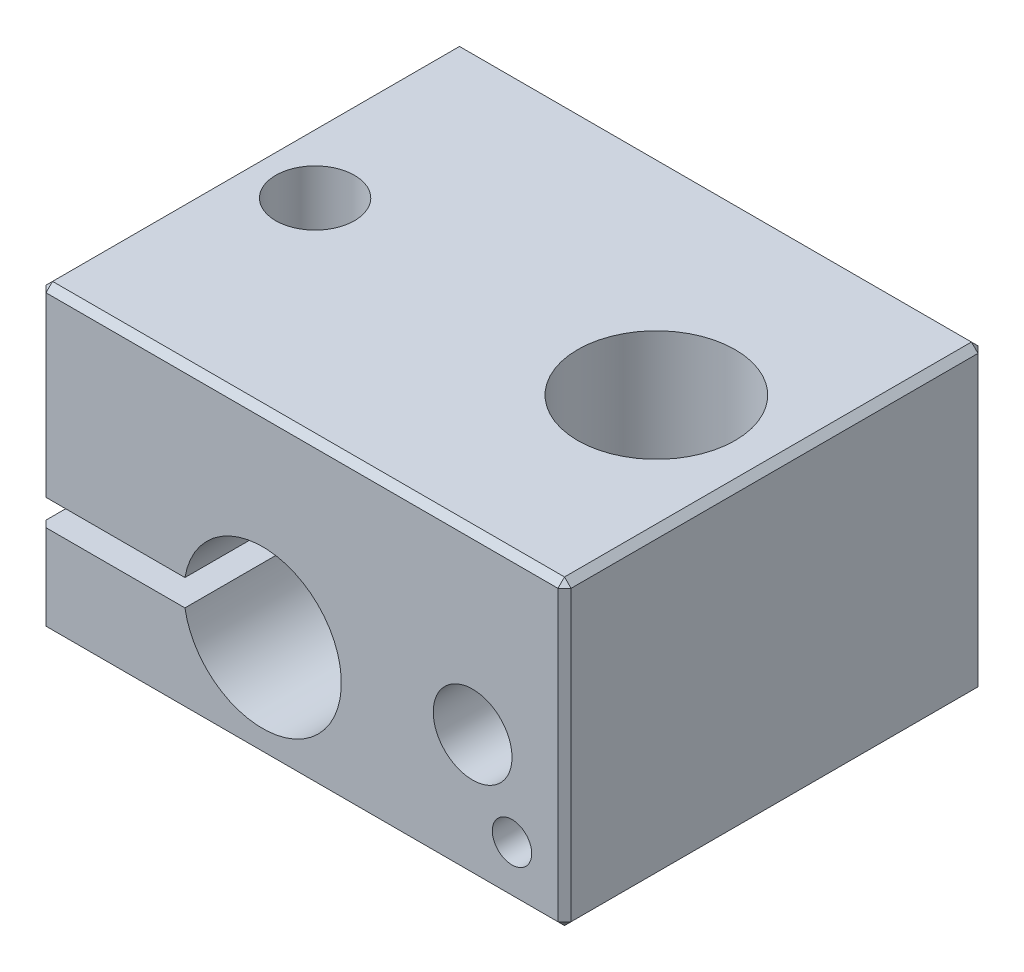
ISO-10303-21;
HEADER;
FILE_DESCRIPTION(('STEP AP214'),'2;1');
FILE_NAME('part.step','',(''),(''),'','','');
FILE_SCHEMA(('AUTOMOTIVE_DESIGN { 1 0 10303 214 1 1 1 1 }'));
ENDSEC;
DATA;
#1=APPLICATION_CONTEXT('core data for automotive mechanical design processes');
#2=APPLICATION_PROTOCOL_DEFINITION('international standard','automotive_design',2000,#1);
#3=PRODUCT_CONTEXT('',#1,'mechanical');
#4=PRODUCT('Part','Part','',(#3));
#5=PRODUCT_RELATED_PRODUCT_CATEGORY('part','',(#4));
#6=PRODUCT_DEFINITION_FORMATION('','',#4);
#7=PRODUCT_DEFINITION_CONTEXT('part definition',#1,'design');
#8=PRODUCT_DEFINITION('design','',#6,#7);
#9=PRODUCT_DEFINITION_SHAPE('','',#8);
#10=(LENGTH_UNIT() NAMED_UNIT(*) SI_UNIT(.MILLI.,.METRE.));
#11=(NAMED_UNIT(*) PLANE_ANGLE_UNIT() SI_UNIT($,.RADIAN.));
#12=(NAMED_UNIT(*) SI_UNIT($,.STERADIAN.) SOLID_ANGLE_UNIT());
#13=UNCERTAINTY_MEASURE_WITH_UNIT(LENGTH_MEASURE(1.E-05),#10,'distance_accuracy_value','');
#14=(GEOMETRIC_REPRESENTATION_CONTEXT(3) GLOBAL_UNCERTAINTY_ASSIGNED_CONTEXT((#13)) GLOBAL_UNIT_ASSIGNED_CONTEXT((#10,
#11,#12)) REPRESENTATION_CONTEXT('',''));
#15=CARTESIAN_POINT('',(0.,0.,0.));
#16=DIRECTION('',(0.,0.,1.));
#17=DIRECTION('',(1.,0.,0.));
#18=AXIS2_PLACEMENT_3D('',#15,#16,#17);
#19=CARTESIAN_POINT('',(7.241,1.241,3.5));
#20=DIRECTION('',(0.,0.,1.));
#21=DIRECTION('',(1.,0.,0.));
#22=AXIS2_PLACEMENT_3D('',#19,#20,#21);
#23=PLANE('',#22);
#24=CARTESIAN_POINT('',(8.,2.,3.5));
#25=DIRECTION('',(0.,0.,1.));
#26=DIRECTION('',(0.,-1.,0.));
#27=AXIS2_PLACEMENT_3D('',#24,#25,#26);
#28=CIRCLE('',#27,0.750000000000001);
#29=CARTESIAN_POINT('',(8.,1.25,3.5));
#30=VERTEX_POINT('',#29);
#31=EDGE_CURVE('E20',#30,#30,#28,.F.);
#32=ORIENTED_EDGE('',*,*,#31,.F.);
#33=EDGE_LOOP('',(#32));
#34=FACE_BOUND('',#33,.T.);
#35=ADVANCED_FACE('F16',(#34),#23,.T.);
#36=CARTESIAN_POINT('',(4.982,3.282,4.5));
#37=DIRECTION('',(0.,0.,1.));
#38=DIRECTION('',(1.,0.,0.));
#39=AXIS2_PLACEMENT_3D('',#36,#37,#38);
#40=PLANE('',#39);
#41=CARTESIAN_POINT('',(6.5,4.8,4.5));
#42=DIRECTION('',(0.,0.,1.));
#43=DIRECTION('',(1.,0.,0.));
#44=AXIS2_PLACEMENT_3D('',#41,#42,#43);
#45=CIRCLE('',#44,1.5);
#46=CARTESIAN_POINT('',(8.,4.8,4.5));
#47=VERTEX_POINT('',#46);
#48=EDGE_CURVE('E295',#47,#47,#45,.F.);
#49=ORIENTED_EDGE('',*,*,#48,.F.);
#50=EDGE_LOOP('',(#49));
#51=FACE_BOUND('',#50,.T.);
#52=ADVANCED_FACE('F309',(#51),#40,.T.);
#53=CARTESIAN_POINT('',(-9.75,3.5,8.));
#54=DIRECTION('',(0.707106781186547,0.,-0.707106781186547));
#55=DIRECTION('',(0.,-1.,0.));
#56=AXIS2_PLACEMENT_3D('',#53,#54,#55);
#57=PLANE('',#56);
#58=DIRECTION('',(0.,-1.,0.));
#59=VECTOR('',#58,1.);
#60=CARTESIAN_POINT('',(-10.,1.875,7.75));
#61=LINE('',#60,#59);
#62=CARTESIAN_POINT('',(-10.,3.5,7.75));
#63=VERTEX_POINT('',#62);
#64=CARTESIAN_POINT('',(-9.999999999969,0.249999999953501,7.749999999969));
#65=VERTEX_POINT('',#64);
#66=EDGE_CURVE('E157',#63,#65,#61,.T.);
#67=ORIENTED_EDGE('',*,*,#66,.T.);
#68=DIRECTION('',(-0.707106781150131,-7.28295973652313E-11,-0.707106781222964));
#69=VECTOR('',#68,1.);
#70=CARTESIAN_POINT('',(-9.75000000003625,0.24999999996375,7.9999999999275));
#71=LINE('',#70,#69);
#72=CARTESIAN_POINT('',(-9.74999999998188,0.249999999972813,7.99999999998188));
#73=VERTEX_POINT('',#72);
#74=EDGE_CURVE('E148',#73,#65,#71,.T.);
#75=ORIENTED_EDGE('',*,*,#74,.F.);
#76=DIRECTION('',(0.,1.,0.));
#77=VECTOR('',#76,1.);
#78=CARTESIAN_POINT('',(-9.75,5.75,8.));
#79=LINE('',#78,#77);
#80=CARTESIAN_POINT('',(-9.75,3.4999999975,8.));
#81=VERTEX_POINT('',#80);
#82=EDGE_CURVE('E141',#73,#81,#79,.T.);
#83=ORIENTED_EDGE('',*,*,#82,.T.);
#84=DIRECTION('',(-0.707106781186547,0.,-0.707106781186547));
#85=VECTOR('',#84,1.);
#86=CARTESIAN_POINT('',(-9.75,3.5,8.));
#87=LINE('',#86,#85);
#88=EDGE_CURVE('E161',#81,#63,#87,.T.);
#89=ORIENTED_EDGE('',*,*,#88,.T.);
#90=EDGE_LOOP('',(#67,#75,#83,#89));
#91=FACE_BOUND('',#90,.T.);
#92=ADVANCED_FACE('F160',(#91),#57,.F.);
#93=CARTESIAN_POINT('',(8.,2.,3.5));
#94=DIRECTION('',(0.,0.,1.));
#95=DIRECTION('',(0.,-1.,0.));
#96=AXIS2_PLACEMENT_3D('',#93,#94,#95);
#97=CYLINDRICAL_SURFACE('',#96,0.750000000000001);
#98=ORIENTED_EDGE('',*,*,#31,.T.);
#99=EDGE_LOOP('',(#98));
#100=FACE_BOUND('',#99,.T.);
#101=CARTESIAN_POINT('',(8.,2.,8.));
#102=DIRECTION('',(0.,0.,1.));
#103=DIRECTION('',(0.,-1.,0.));
#104=AXIS2_PLACEMENT_3D('',#101,#102,#103);
#105=CIRCLE('',#104,0.750000000000001);
#106=CARTESIAN_POINT('',(8.,1.25,8.));
#107=VERTEX_POINT('',#106);
#108=EDGE_CURVE('E279',#107,#107,#105,.T.);
#109=ORIENTED_EDGE('',*,*,#108,.T.);
#110=EDGE_LOOP('',(#109));
#111=FACE_BOUND('',#110,.T.);
#112=ADVANCED_FACE('F305',(#100,#111),#97,.F.);
#113=CARTESIAN_POINT('',(6.5,4.8,4.5));
#114=DIRECTION('',(0.,0.,1.));
#115=DIRECTION('',(1.,0.,0.));
#116=AXIS2_PLACEMENT_3D('',#113,#114,#115);
#117=CYLINDRICAL_SURFACE('',#116,1.5);
#118=ORIENTED_EDGE('',*,*,#48,.T.);
#119=EDGE_LOOP('',(#118));
#120=FACE_BOUND('',#119,.T.);
#121=CARTESIAN_POINT('',(6.5,4.8,8.));
#122=DIRECTION('',(0.,0.,1.));
#123=DIRECTION('',(1.,0.,0.));
#124=AXIS2_PLACEMENT_3D('',#121,#122,#123);
#125=CIRCLE('',#124,1.5);
#126=CARTESIAN_POINT('',(8.,4.8,8.));
#127=VERTEX_POINT('',#126);
#128=EDGE_CURVE('E276',#127,#127,#125,.T.);
#129=ORIENTED_EDGE('',*,*,#128,.T.);
#130=EDGE_LOOP('',(#129));
#131=FACE_BOUND('',#130,.T.);
#132=ADVANCED_FACE('F345',(#120,#131),#117,.F.);
#133=CARTESIAN_POINT('',(10.,11.25,7.75));
#134=DIRECTION('',(-0.707106781186547,0.,-0.707106781186547));
#135=DIRECTION('',(0.,-1.,0.));
#136=AXIS2_PLACEMENT_3D('',#133,#134,#135);
#137=PLANE('',#136);
#138=DIRECTION('',(0.,-1.,0.));
#139=VECTOR('',#138,1.);
#140=CARTESIAN_POINT('',(9.75,5.75,8.));
#141=LINE('',#140,#139);
#142=CARTESIAN_POINT('',(9.75000000000775,11.25,7.99999999999225));
#143=VERTEX_POINT('',#142);
#144=CARTESIAN_POINT('',(9.749999999969,0.2499999999535,7.999999999969));
#145=VERTEX_POINT('',#144);
#146=EDGE_CURVE('E230',#143,#145,#141,.T.);
#147=ORIENTED_EDGE('',*,*,#146,.T.);
#148=DIRECTION('',(-0.707106781222964,-7.28308239999656E-11,0.707106781150131));
#149=VECTOR('',#148,1.);
#150=CARTESIAN_POINT('',(9.9999999999275,0.249999999963749,7.75000000003625));
#151=LINE('',#150,#149);
#152=CARTESIAN_POINT('',(9.99999999998187,0.249999999972812,7.74999999998187));
#153=VERTEX_POINT('',#152);
#154=EDGE_CURVE('E156',#153,#145,#151,.T.);
#155=ORIENTED_EDGE('',*,*,#154,.F.);
#156=DIRECTION('',(0.,1.,0.));
#157=VECTOR('',#156,1.);
#158=CARTESIAN_POINT('',(10.,5.75,7.75));
#159=LINE('',#158,#157);
#160=CARTESIAN_POINT('',(9.9999999999845,11.25,7.7500000000155));
#161=VERTEX_POINT('',#160);
#162=EDGE_CURVE('E218',#153,#161,#159,.T.);
#163=ORIENTED_EDGE('',*,*,#162,.T.);
#164=DIRECTION('',(0.70710678118655,0.,-0.707106781186545));
#165=VECTOR('',#164,1.);
#166=CARTESIAN_POINT('',(9.875,11.25,7.875));
#167=LINE('',#166,#165);
#168=EDGE_CURVE('E250',#143,#161,#167,.T.);
#169=ORIENTED_EDGE('',*,*,#168,.F.);
#170=EDGE_LOOP('',(#147,#155,#163,#169));
#171=FACE_BOUND('',#170,.T.);
#172=ADVANCED_FACE('F347',(#171),#137,.F.);
#173=CARTESIAN_POINT('',(9.75,11.25,-8.));
#174=DIRECTION('',(-0.707106781186547,0.,0.707106781186547));
#175=DIRECTION('',(0.,-1.,0.));
#176=AXIS2_PLACEMENT_3D('',#173,#174,#175);
#177=PLANE('',#176);
#178=DIRECTION('',(0.,1.,0.));
#179=VECTOR('',#178,1.);
#180=CARTESIAN_POINT('',(9.75,5.75,-8.));
#181=LINE('',#180,#179);
#182=CARTESIAN_POINT('',(9.74999999998188,0.249999999972813,-7.99999999998188));
#183=VERTEX_POINT('',#182);
#184=CARTESIAN_POINT('',(9.7500000000155,11.25,-7.9999999999845));
#185=VERTEX_POINT('',#184);
#186=EDGE_CURVE('E237',#183,#185,#181,.T.);
#187=ORIENTED_EDGE('',*,*,#186,.T.);
#188=DIRECTION('',(-0.70710678118655,0.,-0.707106781186545));
#189=VECTOR('',#188,1.);
#190=CARTESIAN_POINT('',(9.875,11.25,-7.875));
#191=LINE('',#190,#189);
#192=CARTESIAN_POINT('',(9.9999999999845,11.25,-7.7500000000155));
#193=VERTEX_POINT('',#192);
#194=EDGE_CURVE('E221',#193,#185,#191,.T.);
#195=ORIENTED_EDGE('',*,*,#194,.F.);
#196=DIRECTION('',(0.,-1.,0.));
#197=VECTOR('',#196,1.);
#198=CARTESIAN_POINT('',(10.,5.75,-7.75));
#199=LINE('',#198,#197);
#200=CARTESIAN_POINT('',(9.999999999969,0.2499999999535,-7.749999999969));
#201=VERTEX_POINT('',#200);
#202=EDGE_CURVE('E222',#193,#201,#199,.T.);
#203=ORIENTED_EDGE('',*,*,#202,.T.);
#204=DIRECTION('',(0.707106781150131,-7.28335839281166E-11,0.707106781222964));
#205=VECTOR('',#204,1.);
#206=CARTESIAN_POINT('',(9.75000000003625,0.24999999996375,-7.9999999999275));
#207=LINE('',#206,#205);
#208=EDGE_CURVE('E293',#183,#201,#207,.T.);
#209=ORIENTED_EDGE('',*,*,#208,.F.);
#210=EDGE_LOOP('',(#187,#195,#203,#209));
#211=FACE_BOUND('',#210,.T.);
#212=ADVANCED_FACE('F358',(#211),#177,.F.);
#213=CARTESIAN_POINT('',(-10.,3.5,-7.75));
#214=DIRECTION('',(0.707106781186547,0.,0.707106781186547));
#215=DIRECTION('',(0.,-1.,0.));
#216=AXIS2_PLACEMENT_3D('',#213,#214,#215);
#217=PLANE('',#216);
#218=DIRECTION('',(0.,-1.,0.));
#219=VECTOR('',#218,1.);
#220=CARTESIAN_POINT('',(-9.75,5.75,-8.));
#221=LINE('',#220,#219);
#222=CARTESIAN_POINT('',(-9.75,3.4999999975,-8.));
#223=VERTEX_POINT('',#222);
#224=CARTESIAN_POINT('',(-9.749999999969,0.249999999953499,-7.999999999969));
#225=VERTEX_POINT('',#224);
#226=EDGE_CURVE('E496',#223,#225,#221,.T.);
#227=ORIENTED_EDGE('',*,*,#226,.T.);
#228=DIRECTION('',(0.707106781222965,-7.28368038442923E-11,-0.70710678115013));
#229=VECTOR('',#228,1.);
#230=CARTESIAN_POINT('',(-9.9999999999275,0.24999999996375,-7.75000000003625));
#231=LINE('',#230,#229);
#232=CARTESIAN_POINT('',(-9.99999999998188,0.249999999972813,-7.74999999998188));
#233=VERTEX_POINT('',#232);
#234=EDGE_CURVE('E291',#233,#225,#231,.T.);
#235=ORIENTED_EDGE('',*,*,#234,.F.);
#236=DIRECTION('',(0.,1.,0.));
#237=VECTOR('',#236,1.);
#238=CARTESIAN_POINT('',(-10.,1.875,-7.75));
#239=LINE('',#238,#237);
#240=CARTESIAN_POINT('',(-10.,3.5,-7.75));
#241=VERTEX_POINT('',#240);
#242=EDGE_CURVE('E166',#233,#241,#239,.T.);
#243=ORIENTED_EDGE('',*,*,#242,.T.);
#244=DIRECTION('',(0.707106781186547,0.,-0.707106781186547));
#245=VECTOR('',#244,1.);
#246=CARTESIAN_POINT('',(-10.,3.5,-7.75));
#247=LINE('',#246,#245);
#248=EDGE_CURVE('E289',#241,#223,#247,.T.);
#249=ORIENTED_EDGE('',*,*,#248,.T.);
#250=EDGE_LOOP('',(#227,#235,#243,#249));
#251=FACE_BOUND('',#250,.T.);
#252=ADVANCED_FACE('F362',(#251),#217,.F.);
#253=CARTESIAN_POINT('',(-10.,11.25,-7.75));
#254=DIRECTION('',(0.707106781186547,0.,0.707106781186547));
#255=DIRECTION('',(0.,-1.,0.));
#256=AXIS2_PLACEMENT_3D('',#253,#254,#255);
#257=PLANE('',#256);
#258=DIRECTION('',(0.,1.,0.));
#259=VECTOR('',#258,1.);
#260=CARTESIAN_POINT('',(-10.,7.875,-7.75));
#261=LINE('',#260,#259);
#262=CARTESIAN_POINT('',(-10.,4.5,-7.75));
#263=VERTEX_POINT('',#262);
#264=CARTESIAN_POINT('',(-9.9999999999845,11.25,-7.7500000000155));
#265=VERTEX_POINT('',#264);
#266=EDGE_CURVE('E194',#263,#265,#261,.T.);
#267=ORIENTED_EDGE('',*,*,#266,.T.);
#268=DIRECTION('',(-0.70710678118655,0.,0.707106781186545));
#269=VECTOR('',#268,1.);
#270=CARTESIAN_POINT('',(-9.875,11.25,-7.875));
#271=LINE('',#270,#269);
#272=CARTESIAN_POINT('',(-9.75,11.25,-8.));
#273=VERTEX_POINT('',#272);
#274=EDGE_CURVE('E215',#273,#265,#271,.T.);
#275=ORIENTED_EDGE('',*,*,#274,.F.);
#276=DIRECTION('',(0.,-1.,0.));
#277=VECTOR('',#276,1.);
#278=CARTESIAN_POINT('',(-9.75,5.75,-8.));
#279=LINE('',#278,#277);
#280=CARTESIAN_POINT('',(-9.7500000005126,4.5,-8.));
#281=VERTEX_POINT('',#280);
#282=EDGE_CURVE('E240',#273,#281,#279,.T.);
#283=ORIENTED_EDGE('',*,*,#282,.T.);
#284=DIRECTION('',(0.707106781186547,0.,-0.707106781186547));
#285=VECTOR('',#284,1.);
#286=CARTESIAN_POINT('',(-9.875,4.5,-7.875));
#287=LINE('',#286,#285);
#288=EDGE_CURVE('E297',#263,#281,#287,.T.);
#289=ORIENTED_EDGE('',*,*,#288,.F.);
#290=EDGE_LOOP('',(#267,#275,#283,#289));
#291=FACE_BOUND('',#290,.T.);
#292=ADVANCED_FACE('F366',(#291),#257,.F.);
#293=CARTESIAN_POINT('',(-9.75,11.25,8.));
#294=DIRECTION('',(0.707106781186547,0.,-0.707106781186547));
#295=DIRECTION('',(0.,-1.,0.));
#296=AXIS2_PLACEMENT_3D('',#293,#294,#295);
#297=PLANE('',#296);
#298=DIRECTION('',(0.,1.,0.));
#299=VECTOR('',#298,1.);
#300=CARTESIAN_POINT('',(-9.75,5.75,8.));
#301=LINE('',#300,#299);
#302=CARTESIAN_POINT('',(-9.7500000002563,4.5,8.));
#303=VERTEX_POINT('',#302);
#304=CARTESIAN_POINT('',(-9.75,11.25,8.));
#305=VERTEX_POINT('',#304);
#306=EDGE_CURVE('E233',#303,#305,#301,.T.);
#307=ORIENTED_EDGE('',*,*,#306,.T.);
#308=DIRECTION('',(0.707106781186547,0.,0.707106781186547));
#309=VECTOR('',#308,1.);
#310=CARTESIAN_POINT('',(-9.875,11.25,7.875));
#311=LINE('',#310,#309);
#312=CARTESIAN_POINT('',(-9.99999999999612,11.25,7.75000000000388));
#313=VERTEX_POINT('',#312);
#314=EDGE_CURVE('E300',#313,#305,#311,.T.);
#315=ORIENTED_EDGE('',*,*,#314,.F.);
#316=DIRECTION('',(0.,-1.,0.));
#317=VECTOR('',#316,1.);
#318=CARTESIAN_POINT('',(-10.,7.875,7.75));
#319=LINE('',#318,#317);
#320=CARTESIAN_POINT('',(-10.,4.5,7.75));
#321=VERTEX_POINT('',#320);
#322=EDGE_CURVE('E190',#313,#321,#319,.T.);
#323=ORIENTED_EDGE('',*,*,#322,.T.);
#324=DIRECTION('',(-0.707106781186547,0.,-0.707106781186547));
#325=VECTOR('',#324,1.);
#326=CARTESIAN_POINT('',(-9.875,4.5,7.875));
#327=LINE('',#326,#325);
#328=EDGE_CURVE('E535',#303,#321,#327,.T.);
#329=ORIENTED_EDGE('',*,*,#328,.F.);
#330=EDGE_LOOP('',(#307,#315,#323,#329));
#331=FACE_BOUND('',#330,.T.);
#332=ADVANCED_FACE('F343',(#331),#297,.F.);
#333=CARTESIAN_POINT('',(-1.5,4.,-8.));
#334=DIRECTION('',(0.,0.,1.));
#335=DIRECTION('',(1.,0.,0.));
#336=AXIS2_PLACEMENT_3D('',#333,#334,#335);
#337=CYLINDRICAL_SURFACE('',#336,3.);
#338=CARTESIAN_POINT('',(-1.5,4.,8.));
#339=DIRECTION('',(0.,0.,1.));
#340=DIRECTION('',(1.,0.,0.));
#341=AXIS2_PLACEMENT_3D('',#338,#339,#340);
#342=CIRCLE('',#341,3.);
#343=CARTESIAN_POINT('',(-4.45803989135233,3.4999999975,8.));
#344=VERTEX_POINT('',#343);
#345=CARTESIAN_POINT('',(-4.4580398917749,4.5,8.));
#346=VERTEX_POINT('',#345);
#347=EDGE_CURVE('E283',#344,#346,#342,.T.);
#348=ORIENTED_EDGE('',*,*,#347,.T.);
#349=DIRECTION('',(0.,0.,-1.));
#350=VECTOR('',#349,1.);
#351=CARTESIAN_POINT('',(-4.458039892,4.5,0.));
#352=LINE('',#351,#350);
#353=CARTESIAN_POINT('',(-4.4580398917749,4.5,-8.));
#354=VERTEX_POINT('',#353);
#355=EDGE_CURVE('E193',#346,#354,#352,.T.);
#356=ORIENTED_EDGE('',*,*,#355,.T.);
#357=CARTESIAN_POINT('',(-1.5,4.,-8.));
#358=DIRECTION('',(0.,0.,1.));
#359=DIRECTION('',(1.,0.,0.));
#360=AXIS2_PLACEMENT_3D('',#357,#358,#359);
#361=CIRCLE('',#360,3.);
#362=CARTESIAN_POINT('',(-4.45803989135233,3.4999999975,-8.));
#363=VERTEX_POINT('',#362);
#364=EDGE_CURVE('E272',#354,#363,#361,.F.);
#365=ORIENTED_EDGE('',*,*,#364,.T.);
#366=DIRECTION('',(0.,0.,1.));
#367=VECTOR('',#366,1.);
#368=CARTESIAN_POINT('',(-4.458039892,3.5,0.));
#369=LINE('',#368,#367);
#370=EDGE_CURVE('E288',#363,#344,#369,.T.);
#371=ORIENTED_EDGE('',*,*,#370,.T.);
#372=EDGE_LOOP('',(#348,#356,#365,#371));
#373=FACE_BOUND('',#372,.T.);
#374=ADVANCED_FACE('F340',(#373),#337,.F.);
#375=CARTESIAN_POINT('',(-10.,0.25,7.75));
#376=DIRECTION('',(1.,0.,0.));
#377=DIRECTION('',(0.,0.,-1.));
#378=AXIS2_PLACEMENT_3D('',#375,#376,#377);
#379=PLANE('',#378);
#380=ORIENTED_EDGE('',*,*,#66,.F.);
#381=DIRECTION('',(0.,0.,-1.));
#382=VECTOR('',#381,1.);
#383=CARTESIAN_POINT('',(-10.,3.5,0.));
#384=LINE('',#383,#382);
#385=EDGE_CURVE('E286',#63,#241,#384,.T.);
#386=ORIENTED_EDGE('',*,*,#385,.T.);
#387=ORIENTED_EDGE('',*,*,#242,.F.);
#388=DIRECTION('',(0.,0.,1.));
#389=VECTOR('',#388,1.);
#390=CARTESIAN_POINT('',(-10.,0.25,0.));
#391=LINE('',#390,#389);
#392=EDGE_CURVE('E172',#233,#65,#391,.T.);
#393=ORIENTED_EDGE('',*,*,#392,.T.);
#394=EDGE_LOOP('',(#380,#386,#387,#393));
#395=FACE_BOUND('',#394,.T.);
#396=ADVANCED_FACE('F178',(#395),#379,.F.);
#397=CARTESIAN_POINT('',(-10.0015,0.2515,7.75));
#398=DIRECTION('',(-0.577350269189626,-0.577350269189629,0.577350269189622));
#399=DIRECTION('',(0.70710678118655,-0.707106781186545,0.));
#400=AXIS2_PLACEMENT_3D('',#397,#398,#399);
#401=PLANE('',#400);
#402=DIRECTION('',(0.707106781186548,-0.707106781186547,0.));
#403=VECTOR('',#402,1.);
#404=CARTESIAN_POINT('',(-9.875,0.125,7.75));
#405=LINE('',#404,#403);
#406=CARTESIAN_POINT('',(-9.750000000031,3.09999975713535E-11,7.75));
#407=VERTEX_POINT('',#406);
#408=EDGE_CURVE('E152',#65,#407,#405,.T.);
#409=ORIENTED_EDGE('',*,*,#408,.T.);
#410=DIRECTION('',(0.,0.707106781186547,0.707106781186548));
#411=VECTOR('',#410,1.);
#412=CARTESIAN_POINT('',(-9.75,0.125,7.875));
#413=LINE('',#412,#411);
#414=EDGE_CURVE('E154',#407,#73,#413,.T.);
#415=ORIENTED_EDGE('',*,*,#414,.T.);
#416=ORIENTED_EDGE('',*,*,#74,.T.);
#417=EDGE_LOOP('',(#409,#415,#416));
#418=FACE_BOUND('',#417,.T.);
#419=ADVANCED_FACE('F150',(#418),#401,.T.);
#420=CARTESIAN_POINT('',(9.75,0.2515,8.0015));
#421=DIRECTION('',(0.577350269189625,-0.577350269189626,0.577350269189627));
#422=DIRECTION('',(0.,-0.707106781186548,-0.707106781186547));
#423=AXIS2_PLACEMENT_3D('',#420,#421,#422);
#424=PLANE('',#423);
#425=DIRECTION('',(0.707106781186548,0.707106781186547,0.));
#426=VECTOR('',#425,1.);
#427=CARTESIAN_POINT('',(9.875,0.125,7.75));
#428=LINE('',#427,#426);
#429=CARTESIAN_POINT('',(9.75,3.09999975713535E-11,7.750000000031));
#430=VERTEX_POINT('',#429);
#431=EDGE_CURVE('E227',#430,#153,#428,.T.);
#432=ORIENTED_EDGE('',*,*,#431,.T.);
#433=ORIENTED_EDGE('',*,*,#154,.T.);
#434=DIRECTION('',(0.,-0.707106781186547,-0.707106781186548));
#435=VECTOR('',#434,1.);
#436=CARTESIAN_POINT('',(9.75,0.125,7.875));
#437=LINE('',#436,#435);
#438=EDGE_CURVE('E234',#145,#430,#437,.T.);
#439=ORIENTED_EDGE('',*,*,#438,.T.);
#440=EDGE_LOOP('',(#432,#433,#439));
#441=FACE_BOUND('',#440,.T.);
#442=ADVANCED_FACE('F378',(#441),#424,.T.);
#443=CARTESIAN_POINT('',(9.62275,0.12425,-8.0015));
#444=DIRECTION('',(0.577350269189623,-0.57735026918963,-0.577350269189624));
#445=DIRECTION('',(0.707106781186552,0.707106781186543,0.));
#446=AXIS2_PLACEMENT_3D('',#443,#444,#445);
#447=PLANE('',#446);
#448=ORIENTED_EDGE('',*,*,#208,.T.);
#449=DIRECTION('',(-0.707106781186548,-0.707106781186547,0.));
#450=VECTOR('',#449,1.);
#451=CARTESIAN_POINT('',(9.875,0.125,-7.75));
#452=LINE('',#451,#450);
#453=CARTESIAN_POINT('',(9.750000000031,3.0999999794815E-11,-7.75));
#454=VERTEX_POINT('',#453);
#455=EDGE_CURVE('E226',#201,#454,#452,.T.);
#456=ORIENTED_EDGE('',*,*,#455,.T.);
#457=DIRECTION('',(0.,0.707106781186547,-0.707106781186548));
#458=VECTOR('',#457,1.);
#459=CARTESIAN_POINT('',(9.75,0.125,-7.875));
#460=LINE('',#459,#458);
#461=EDGE_CURVE('E245',#454,#183,#460,.T.);
#462=ORIENTED_EDGE('',*,*,#461,.T.);
#463=EDGE_LOOP('',(#448,#456,#462));
#464=FACE_BOUND('',#463,.T.);
#465=ADVANCED_FACE('F381',(#464),#447,.T.);
#466=CARTESIAN_POINT('',(-10.0015,0.12425,-7.62275));
#467=DIRECTION('',(-0.577350269189627,-0.577350269189627,-0.577350269189623));
#468=DIRECTION('',(0.,0.707106781186545,-0.70710678118655));
#469=AXIS2_PLACEMENT_3D('',#466,#467,#468);
#470=PLANE('',#469);
#471=ORIENTED_EDGE('',*,*,#234,.T.);
#472=DIRECTION('',(0.,-0.707106781186547,0.707106781186548));
#473=VECTOR('',#472,1.);
#474=CARTESIAN_POINT('',(-9.75,0.125,-7.875));
#475=LINE('',#474,#473);
#476=CARTESIAN_POINT('',(-9.75,3.0999999794815E-11,-7.750000000031));
#477=VERTEX_POINT('',#476);
#478=EDGE_CURVE('E244',#225,#477,#475,.T.);
#479=ORIENTED_EDGE('',*,*,#478,.T.);
#480=DIRECTION('',(-0.707106781186548,0.707106781186547,0.));
#481=VECTOR('',#480,1.);
#482=CARTESIAN_POINT('',(-9.875,0.125,-7.75));
#483=LINE('',#482,#481);
#484=EDGE_CURVE('E176',#477,#233,#483,.T.);
#485=ORIENTED_EDGE('',*,*,#484,.T.);
#486=EDGE_LOOP('',(#471,#479,#485));
#487=FACE_BOUND('',#486,.T.);
#488=ADVANCED_FACE('F385',(#487),#470,.T.);
#489=CARTESIAN_POINT('',(-10.,3.5,-8.));
#490=DIRECTION('',(0.,-1.,0.));
#491=DIRECTION('',(1.,0.,0.));
#492=AXIS2_PLACEMENT_3D('',#489,#490,#491);
#493=PLANE('',#492);
#494=CARTESIAN_POINT('',(-7.5,3.5,0.));
#495=DIRECTION('',(0.,1.,0.));
#496=DIRECTION('',(0.,0.,1.));
#497=AXIS2_PLACEMENT_3D('',#494,#495,#496);
#498=CIRCLE('',#497,1.5);
#499=CARTESIAN_POINT('',(-7.5,3.5,1.5));
#500=VERTEX_POINT('',#499);
#501=EDGE_CURVE('E254',#500,#500,#498,.T.);
#502=ORIENTED_EDGE('',*,*,#501,.F.);
#503=EDGE_LOOP('',(#502));
#504=FACE_BOUND('',#503,.T.);
#505=ORIENTED_EDGE('',*,*,#88,.F.);
#506=DIRECTION('',(1.,0.,0.));
#507=VECTOR('',#506,1.);
#508=CARTESIAN_POINT('',(0.,3.499999995,8.));
#509=LINE('',#508,#507);
#510=EDGE_CURVE('E282',#81,#344,#509,.T.);
#511=ORIENTED_EDGE('',*,*,#510,.T.);
#512=ORIENTED_EDGE('',*,*,#370,.F.);
#513=DIRECTION('',(-1.,0.,0.));
#514=VECTOR('',#513,1.);
#515=CARTESIAN_POINT('',(0.,3.499999995,-8.));
#516=LINE('',#515,#514);
#517=EDGE_CURVE('E275',#363,#223,#516,.T.);
#518=ORIENTED_EDGE('',*,*,#517,.T.);
#519=ORIENTED_EDGE('',*,*,#248,.F.);
#520=ORIENTED_EDGE('',*,*,#385,.F.);
#521=EDGE_LOOP('',(#505,#511,#512,#518,#519,#520));
#522=FACE_BOUND('',#521,.T.);
#523=ADVANCED_FACE('F389',(#504,#522),#493,.F.);
#524=CARTESIAN_POINT('',(9.75,0.25,8.));
#525=DIRECTION('',(0.,0.,-1.));
#526=DIRECTION('',(-1.,0.,0.));
#527=AXIS2_PLACEMENT_3D('',#524,#525,#526);
#528=PLANE('',#527);
#529=ORIENTED_EDGE('',*,*,#128,.F.);
#530=EDGE_LOOP('',(#529));
#531=FACE_BOUND('',#530,.T.);
#532=ORIENTED_EDGE('',*,*,#108,.F.);
#533=EDGE_LOOP('',(#532));
#534=FACE_BOUND('',#533,.T.);
#535=ORIENTED_EDGE('',*,*,#82,.F.);
#536=DIRECTION('',(1.,0.,0.));
#537=VECTOR('',#536,1.);
#538=CARTESIAN_POINT('',(0.,0.25,8.));
#539=LINE('',#538,#537);
#540=EDGE_CURVE('E189',#73,#145,#539,.T.);
#541=ORIENTED_EDGE('',*,*,#540,.T.);
#542=ORIENTED_EDGE('',*,*,#146,.F.);
#543=DIRECTION('',(1.,0.,0.));
#544=VECTOR('',#543,1.);
#545=CARTESIAN_POINT('',(0.,11.25,8.));
#546=LINE('',#545,#544);
#547=EDGE_CURVE('E493',#305,#143,#546,.T.);
#548=ORIENTED_EDGE('',*,*,#547,.F.);
#549=ORIENTED_EDGE('',*,*,#306,.F.);
#550=DIRECTION('',(1.,0.,0.));
#551=VECTOR('',#550,1.);
#552=CARTESIAN_POINT('',(-7.229019946,4.5,8.));
#553=LINE('',#552,#551);
#554=EDGE_CURVE('E180',#303,#346,#553,.T.);
#555=ORIENTED_EDGE('',*,*,#554,.T.);
#556=ORIENTED_EDGE('',*,*,#347,.F.);
#557=ORIENTED_EDGE('',*,*,#510,.F.);
#558=EDGE_LOOP('',(#535,#541,#542,#548,#549,#555,#556,#557));
#559=FACE_BOUND('',#558,.T.);
#560=ADVANCED_FACE('F393',(#531,#534,#559),#528,.F.);
#561=CARTESIAN_POINT('',(9.7485,11.25,8.0015));
#562=DIRECTION('',(0.577350269189625,0.577350269189623,0.577350269189629));
#563=DIRECTION('',(0.70710678118655,0.,-0.707106781186545));
#564=AXIS2_PLACEMENT_3D('',#561,#562,#563);
#565=PLANE('',#564);
#566=DIRECTION('',(0.,0.707106781186547,-0.707106781186547));
#567=VECTOR('',#566,1.);
#568=CARTESIAN_POINT('',(9.75,11.375,7.875));
#569=LINE('',#568,#567);
#570=CARTESIAN_POINT('',(9.75000000008876,11.4999999998931,7.75000000001813));
#571=VERTEX_POINT('',#570);
#572=EDGE_CURVE('E491',#143,#571,#569,.T.);
#573=ORIENTED_EDGE('',*,*,#572,.F.);
#574=ORIENTED_EDGE('',*,*,#168,.T.);
#575=DIRECTION('',(0.707106781186547,-0.707106781186547,0.));
#576=VECTOR('',#575,1.);
#577=CARTESIAN_POINT('',(9.875,11.375,7.75));
#578=LINE('',#577,#576);
#579=EDGE_CURVE('E486',#571,#161,#578,.T.);
#580=ORIENTED_EDGE('',*,*,#579,.F.);
#581=EDGE_LOOP('',(#573,#574,#580));
#582=FACE_BOUND('',#581,.T.);
#583=ADVANCED_FACE('F397',(#582),#565,.T.);
#584=CARTESIAN_POINT('',(10.,0.25,-7.75));
#585=DIRECTION('',(-1.,0.,0.));
#586=DIRECTION('',(0.,0.,1.));
#587=AXIS2_PLACEMENT_3D('',#584,#585,#586);
#588=PLANE('',#587);
#589=ORIENTED_EDGE('',*,*,#162,.F.);
#590=DIRECTION('',(0.,0.,-1.));
#591=VECTOR('',#590,1.);
#592=CARTESIAN_POINT('',(10.,0.25,0.));
#593=LINE('',#592,#591);
#594=EDGE_CURVE('E223',#153,#201,#593,.T.);
#595=ORIENTED_EDGE('',*,*,#594,.T.);
#596=ORIENTED_EDGE('',*,*,#202,.F.);
#597=DIRECTION('',(0.,0.,-1.));
#598=VECTOR('',#597,1.);
#599=CARTESIAN_POINT('',(10.,11.25,0.));
#600=LINE('',#599,#598);
#601=EDGE_CURVE('E483',#161,#193,#600,.T.);
#602=ORIENTED_EDGE('',*,*,#601,.F.);
#603=EDGE_LOOP('',(#589,#595,#596,#602));
#604=FACE_BOUND('',#603,.T.);
#605=ADVANCED_FACE('F401',(#604),#588,.F.);
#606=CARTESIAN_POINT('',(10.0015,11.25,-7.7485));
#607=DIRECTION('',(0.577350269189625,0.577350269189623,-0.577350269189629));
#608=DIRECTION('',(-0.70710678118655,0.,-0.707106781186545));
#609=AXIS2_PLACEMENT_3D('',#606,#607,#608);
#610=PLANE('',#609);
#611=DIRECTION('',(0.,-0.707106781186547,-0.707106781186547));
#612=VECTOR('',#611,1.);
#613=CARTESIAN_POINT('',(9.75,11.375,-7.875));
#614=LINE('',#613,#612);
#615=CARTESIAN_POINT('',(9.75000000001813,11.4999999998931,-7.75000000008876));
#616=VERTEX_POINT('',#615);
#617=EDGE_CURVE('E480',#616,#185,#614,.T.);
#618=ORIENTED_EDGE('',*,*,#617,.F.);
#619=DIRECTION('',(-0.707106781186547,0.707106781186547,0.));
#620=VECTOR('',#619,1.);
#621=CARTESIAN_POINT('',(9.875,11.375,-7.75));
#622=LINE('',#621,#620);
#623=EDGE_CURVE('E489',#193,#616,#622,.T.);
#624=ORIENTED_EDGE('',*,*,#623,.F.);
#625=ORIENTED_EDGE('',*,*,#194,.T.);
#626=EDGE_LOOP('',(#618,#624,#625));
#627=FACE_BOUND('',#626,.T.);
#628=ADVANCED_FACE('F405',(#627),#610,.T.);
#629=CARTESIAN_POINT('',(-9.75,0.25,-8.));
#630=DIRECTION('',(0.,0.,1.));
#631=DIRECTION('',(1.,0.,0.));
#632=AXIS2_PLACEMENT_3D('',#629,#630,#631);
#633=PLANE('',#632);
#634=ORIENTED_EDGE('',*,*,#226,.F.);
#635=ORIENTED_EDGE('',*,*,#517,.F.);
#636=ORIENTED_EDGE('',*,*,#364,.F.);
#637=DIRECTION('',(-1.,0.,0.));
#638=VECTOR('',#637,1.);
#639=CARTESIAN_POINT('',(-7.229019946,4.5,-8.));
#640=LINE('',#639,#638);
#641=EDGE_CURVE('E199',#354,#281,#640,.T.);
#642=ORIENTED_EDGE('',*,*,#641,.T.);
#643=ORIENTED_EDGE('',*,*,#282,.F.);
#644=DIRECTION('',(-1.,0.,0.));
#645=VECTOR('',#644,1.);
#646=CARTESIAN_POINT('',(0.,11.25,-8.));
#647=LINE('',#646,#645);
#648=EDGE_CURVE('E479',#185,#273,#647,.T.);
#649=ORIENTED_EDGE('',*,*,#648,.F.);
#650=ORIENTED_EDGE('',*,*,#186,.F.);
#651=DIRECTION('',(-1.,0.,0.));
#652=VECTOR('',#651,1.);
#653=CARTESIAN_POINT('',(0.,0.25,-8.));
#654=LINE('',#653,#652);
#655=EDGE_CURVE('E241',#183,#225,#654,.T.);
#656=ORIENTED_EDGE('',*,*,#655,.T.);
#657=EDGE_LOOP('',(#634,#635,#636,#642,#643,#649,#650,#656));
#658=FACE_BOUND('',#657,.T.);
#659=ADVANCED_FACE('F409',(#658),#633,.F.);
#660=CARTESIAN_POINT('',(-9.7485,11.25,-8.0015));
#661=DIRECTION('',(-0.577350269189625,0.577350269189623,-0.577350269189629));
#662=DIRECTION('',(-0.70710678118655,0.,0.707106781186545));
#663=AXIS2_PLACEMENT_3D('',#660,#661,#662);
#664=PLANE('',#663);
#665=ORIENTED_EDGE('',*,*,#274,.T.);
#666=DIRECTION('',(-0.707106781186547,-0.707106781186547,0.));
#667=VECTOR('',#666,1.);
#668=CARTESIAN_POINT('',(-9.875,11.375,-7.75));
#669=LINE('',#668,#667);
#670=CARTESIAN_POINT('',(-9.75000000001813,11.4999999998931,-7.75000000008876));
#671=VERTEX_POINT('',#670);
#672=EDGE_CURVE('E206',#671,#265,#669,.T.);
#673=ORIENTED_EDGE('',*,*,#672,.F.);
#674=DIRECTION('',(0.,0.707106781186547,0.707106781186547));
#675=VECTOR('',#674,1.);
#676=CARTESIAN_POINT('',(-9.75,11.375,-7.875));
#677=LINE('',#676,#675);
#678=EDGE_CURVE('E35',#273,#671,#677,.T.);
#679=ORIENTED_EDGE('',*,*,#678,.F.);
#680=EDGE_LOOP('',(#665,#673,#679));
#681=FACE_BOUND('',#680,.T.);
#682=ADVANCED_FACE('F413',(#681),#664,.T.);
#683=CARTESIAN_POINT('',(-10.,4.5,7.75));
#684=DIRECTION('',(1.,0.,0.));
#685=DIRECTION('',(0.,0.,-1.));
#686=AXIS2_PLACEMENT_3D('',#683,#684,#685);
#687=PLANE('',#686);
#688=ORIENTED_EDGE('',*,*,#322,.F.);
#689=DIRECTION('',(0.,0.,1.));
#690=VECTOR('',#689,1.);
#691=CARTESIAN_POINT('',(-10.,11.25,0.));
#692=LINE('',#691,#690);
#693=EDGE_CURVE('E202',#265,#313,#692,.T.);
#694=ORIENTED_EDGE('',*,*,#693,.F.);
#695=ORIENTED_EDGE('',*,*,#266,.F.);
#696=DIRECTION('',(0.,0.,1.));
#697=VECTOR('',#696,1.);
#698=CARTESIAN_POINT('',(-10.,4.5,0.));
#699=LINE('',#698,#697);
#700=EDGE_CURVE('E183',#263,#321,#699,.T.);
#701=ORIENTED_EDGE('',*,*,#700,.T.);
#702=EDGE_LOOP('',(#688,#694,#695,#701));
#703=FACE_BOUND('',#702,.T.);
#704=ADVANCED_FACE('F417',(#703),#687,.F.);
#705=CARTESIAN_POINT('',(-10.0015,11.25,7.7485));
#706=DIRECTION('',(-0.577350269189625,0.577350269189623,0.577350269189629));
#707=DIRECTION('',(0.70710678118655,0.,0.707106781186545));
#708=AXIS2_PLACEMENT_3D('',#705,#706,#707);
#709=PLANE('',#708);
#710=ORIENTED_EDGE('',*,*,#314,.T.);
#711=DIRECTION('',(0.,-0.707106781186547,0.707106781186547));
#712=VECTOR('',#711,1.);
#713=CARTESIAN_POINT('',(-9.75,11.375,7.875));
#714=LINE('',#713,#712);
#715=CARTESIAN_POINT('',(-9.75000000008876,11.4999999998931,7.75000000001812));
#716=VERTEX_POINT('',#715);
#717=EDGE_CURVE('E271',#716,#305,#714,.T.);
#718=ORIENTED_EDGE('',*,*,#717,.F.);
#719=DIRECTION('',(0.707106781186547,0.707106781186547,0.));
#720=VECTOR('',#719,1.);
#721=CARTESIAN_POINT('',(-9.875,11.375,7.75));
#722=LINE('',#721,#720);
#723=EDGE_CURVE('E205',#313,#716,#722,.T.);
#724=ORIENTED_EDGE('',*,*,#723,.F.);
#725=EDGE_LOOP('',(#710,#718,#724));
#726=FACE_BOUND('',#725,.T.);
#727=ADVANCED_FACE('F421',(#726),#709,.T.);
#728=CARTESIAN_POINT('',(-4.458039892,4.5,-8.));
#729=DIRECTION('',(0.,1.,0.));
#730=DIRECTION('',(-1.,0.,0.));
#731=AXIS2_PLACEMENT_3D('',#728,#729,#730);
#732=PLANE('',#731);
#733=CARTESIAN_POINT('',(-7.5,4.5,0.));
#734=DIRECTION('',(0.,1.,0.));
#735=DIRECTION('',(0.,0.,1.));
#736=AXIS2_PLACEMENT_3D('',#733,#734,#735);
#737=CIRCLE('',#736,1.5);
#738=CARTESIAN_POINT('',(-7.5,4.5,1.5));
#739=VERTEX_POINT('',#738);
#740=EDGE_CURVE('E210',#739,#739,#737,.F.);
#741=ORIENTED_EDGE('',*,*,#740,.F.);
#742=EDGE_LOOP('',(#741));
#743=FACE_BOUND('',#742,.T.);
#744=ORIENTED_EDGE('',*,*,#328,.T.);
#745=ORIENTED_EDGE('',*,*,#700,.F.);
#746=ORIENTED_EDGE('',*,*,#288,.T.);
#747=ORIENTED_EDGE('',*,*,#641,.F.);
#748=ORIENTED_EDGE('',*,*,#355,.F.);
#749=ORIENTED_EDGE('',*,*,#554,.F.);
#750=EDGE_LOOP('',(#744,#745,#746,#747,#748,#749));
#751=FACE_BOUND('',#750,.T.);
#752=ADVANCED_FACE('F425',(#743,#751),#732,.F.);
#753=CARTESIAN_POINT('',(-10.,0.25,-7.75));
#754=DIRECTION('',(0.707106781186547,0.707106781186548,0.));
#755=DIRECTION('',(0.,0.,1.));
#756=AXIS2_PLACEMENT_3D('',#753,#754,#755);
#757=PLANE('',#756);
#758=DIRECTION('',(0.,0.,1.));
#759=VECTOR('',#758,1.);
#760=CARTESIAN_POINT('',(-9.75,0.,0.));
#761=LINE('',#760,#759);
#762=EDGE_CURVE('E175',#477,#407,#761,.T.);
#763=ORIENTED_EDGE('',*,*,#762,.T.);
#764=ORIENTED_EDGE('',*,*,#408,.F.);
#765=ORIENTED_EDGE('',*,*,#392,.F.);
#766=ORIENTED_EDGE('',*,*,#484,.F.);
#767=EDGE_LOOP('',(#763,#764,#765,#766));
#768=FACE_BOUND('',#767,.T.);
#769=ADVANCED_FACE('F171',(#768),#757,.F.);
#770=CARTESIAN_POINT('',(-9.75,0.25,8.));
#771=DIRECTION('',(0.,0.707106781186548,-0.707106781186547));
#772=DIRECTION('',(1.,0.,0.));
#773=AXIS2_PLACEMENT_3D('',#770,#771,#772);
#774=PLANE('',#773);
#775=DIRECTION('',(1.,0.,0.));
#776=VECTOR('',#775,1.);
#777=CARTESIAN_POINT('',(0.,0.,7.75));
#778=LINE('',#777,#776);
#779=EDGE_CURVE('E468',#407,#430,#778,.T.);
#780=ORIENTED_EDGE('',*,*,#779,.T.);
#781=ORIENTED_EDGE('',*,*,#438,.F.);
#782=ORIENTED_EDGE('',*,*,#540,.F.);
#783=ORIENTED_EDGE('',*,*,#414,.F.);
#784=EDGE_LOOP('',(#780,#781,#782,#783));
#785=FACE_BOUND('',#784,.T.);
#786=ADVANCED_FACE('F432',(#785),#774,.F.);
#787=CARTESIAN_POINT('',(10.,0.25,7.75));
#788=DIRECTION('',(-0.707106781186547,0.707106781186548,0.));
#789=DIRECTION('',(0.,0.,-1.));
#790=AXIS2_PLACEMENT_3D('',#787,#788,#789);
#791=PLANE('',#790);
#792=ORIENTED_EDGE('',*,*,#594,.F.);
#793=ORIENTED_EDGE('',*,*,#431,.F.);
#794=DIRECTION('',(0.,0.,-1.));
#795=VECTOR('',#794,1.);
#796=CARTESIAN_POINT('',(9.75,0.,0.));
#797=LINE('',#796,#795);
#798=EDGE_CURVE('E466',#430,#454,#797,.T.);
#799=ORIENTED_EDGE('',*,*,#798,.T.);
#800=ORIENTED_EDGE('',*,*,#455,.F.);
#801=EDGE_LOOP('',(#792,#793,#799,#800));
#802=FACE_BOUND('',#801,.T.);
#803=ADVANCED_FACE('F435',(#802),#791,.F.);
#804=CARTESIAN_POINT('',(9.75,0.25,-8.));
#805=DIRECTION('',(0.,0.707106781186548,0.707106781186547));
#806=DIRECTION('',(-1.,0.,0.));
#807=AXIS2_PLACEMENT_3D('',#804,#805,#806);
#808=PLANE('',#807);
#809=ORIENTED_EDGE('',*,*,#655,.F.);
#810=ORIENTED_EDGE('',*,*,#461,.F.);
#811=DIRECTION('',(-1.,0.,0.));
#812=VECTOR('',#811,1.);
#813=CARTESIAN_POINT('',(0.,0.,-7.75));
#814=LINE('',#813,#812);
#815=EDGE_CURVE('E266',#454,#477,#814,.T.);
#816=ORIENTED_EDGE('',*,*,#815,.T.);
#817=ORIENTED_EDGE('',*,*,#478,.F.);
#818=EDGE_LOOP('',(#809,#810,#816,#817));
#819=FACE_BOUND('',#818,.T.);
#820=ADVANCED_FACE('F338',(#819),#808,.F.);
#821=CARTESIAN_POINT('',(-7.5,0.,0.));
#822=DIRECTION('',(0.,1.,0.));
#823=DIRECTION('',(0.,0.,1.));
#824=AXIS2_PLACEMENT_3D('',#821,#822,#823);
#825=CYLINDRICAL_SURFACE('',#824,1.5);
#826=CARTESIAN_POINT('',(-7.5,0.,0.));
#827=DIRECTION('',(0.,1.,0.));
#828=DIRECTION('',(0.,0.,1.));
#829=AXIS2_PLACEMENT_3D('',#826,#827,#828);
#830=CIRCLE('',#829,1.5);
#831=CARTESIAN_POINT('',(-7.5,0.,1.5));
#832=VERTEX_POINT('',#831);
#833=EDGE_CURVE('E262',#832,#832,#830,.F.);
#834=ORIENTED_EDGE('',*,*,#833,.T.);
#835=EDGE_LOOP('',(#834));
#836=FACE_BOUND('',#835,.T.);
#837=ORIENTED_EDGE('',*,*,#501,.T.);
#838=EDGE_LOOP('',(#837));
#839=FACE_BOUND('',#838,.T.);
#840=ADVANCED_FACE('F334',(#836,#839),#825,.F.);
#841=CARTESIAN_POINT('',(9.75,11.5,7.75));
#842=DIRECTION('',(0.,0.707106781186547,0.707106781186547));
#843=DIRECTION('',(-1.,0.,0.));
#844=AXIS2_PLACEMENT_3D('',#841,#842,#843);
#845=PLANE('',#844);
#846=ORIENTED_EDGE('',*,*,#572,.T.);
#847=DIRECTION('',(1.,0.,0.));
#848=VECTOR('',#847,1.);
#849=CARTESIAN_POINT('',(0.,11.5,7.75));
#850=LINE('',#849,#848);
#851=EDGE_CURVE('E265',#716,#571,#850,.T.);
#852=ORIENTED_EDGE('',*,*,#851,.F.);
#853=ORIENTED_EDGE('',*,*,#717,.T.);
#854=ORIENTED_EDGE('',*,*,#547,.T.);
#855=EDGE_LOOP('',(#846,#852,#853,#854));
#856=FACE_BOUND('',#855,.T.);
#857=ADVANCED_FACE('F337',(#856),#845,.T.);
#858=CARTESIAN_POINT('',(9.75,11.5,-7.75));
#859=DIRECTION('',(0.707106781186547,0.707106781186547,0.));
#860=DIRECTION('',(0.,0.,1.));
#861=AXIS2_PLACEMENT_3D('',#858,#859,#860);
#862=PLANE('',#861);
#863=ORIENTED_EDGE('',*,*,#579,.T.);
#864=ORIENTED_EDGE('',*,*,#601,.T.);
#865=ORIENTED_EDGE('',*,*,#623,.T.);
#866=DIRECTION('',(0.,0.,-1.));
#867=VECTOR('',#866,1.);
#868=CARTESIAN_POINT('',(9.75,11.5,0.));
#869=LINE('',#868,#867);
#870=EDGE_CURVE('E572',#571,#616,#869,.T.);
#871=ORIENTED_EDGE('',*,*,#870,.F.);
#872=EDGE_LOOP('',(#863,#864,#865,#871));
#873=FACE_BOUND('',#872,.T.);
#874=ADVANCED_FACE('F445',(#873),#862,.T.);
#875=CARTESIAN_POINT('',(-9.75,11.5,-7.75));
#876=DIRECTION('',(0.,0.707106781186547,-0.707106781186547));
#877=DIRECTION('',(1.,0.,0.));
#878=AXIS2_PLACEMENT_3D('',#875,#876,#877);
#879=PLANE('',#878);
#880=ORIENTED_EDGE('',*,*,#617,.T.);
#881=ORIENTED_EDGE('',*,*,#648,.T.);
#882=ORIENTED_EDGE('',*,*,#678,.T.);
#883=DIRECTION('',(-1.,0.,0.));
#884=VECTOR('',#883,1.);
#885=CARTESIAN_POINT('',(0.,11.5,-7.75));
#886=LINE('',#885,#884);
#887=EDGE_CURVE('E570',#616,#671,#886,.T.);
#888=ORIENTED_EDGE('',*,*,#887,.F.);
#889=EDGE_LOOP('',(#880,#881,#882,#888));
#890=FACE_BOUND('',#889,.T.);
#891=ADVANCED_FACE('F449',(#890),#879,.T.);
#892=CARTESIAN_POINT('',(-9.75,11.5,7.75));
#893=DIRECTION('',(-0.707106781186547,0.707106781186547,0.));
#894=DIRECTION('',(0.,0.,-1.));
#895=AXIS2_PLACEMENT_3D('',#892,#893,#894);
#896=PLANE('',#895);
#897=ORIENTED_EDGE('',*,*,#723,.T.);
#898=DIRECTION('',(0.,0.,1.));
#899=VECTOR('',#898,1.);
#900=CARTESIAN_POINT('',(-9.75,11.5,0.));
#901=LINE('',#900,#899);
#902=EDGE_CURVE('E261',#671,#716,#901,.T.);
#903=ORIENTED_EDGE('',*,*,#902,.F.);
#904=ORIENTED_EDGE('',*,*,#672,.T.);
#905=ORIENTED_EDGE('',*,*,#693,.T.);
#906=EDGE_LOOP('',(#897,#903,#904,#905));
#907=FACE_BOUND('',#906,.T.);
#908=ADVANCED_FACE('F332',(#907),#896,.T.);
#909=CARTESIAN_POINT('',(-7.5,4.5,0.));
#910=DIRECTION('',(0.,1.,0.));
#911=DIRECTION('',(0.,0.,1.));
#912=AXIS2_PLACEMENT_3D('',#909,#910,#911);
#913=CYLINDRICAL_SURFACE('',#912,1.5);
#914=CARTESIAN_POINT('',(-7.5,11.5,0.));
#915=DIRECTION('',(0.,1.,0.));
#916=DIRECTION('',(0.,0.,1.));
#917=AXIS2_PLACEMENT_3D('',#914,#915,#916);
#918=CIRCLE('',#917,1.5);
#919=CARTESIAN_POINT('',(-7.5,11.5,1.5));
#920=VERTEX_POINT('',#919);
#921=EDGE_CURVE('E258',#920,#920,#918,.F.);
#922=ORIENTED_EDGE('',*,*,#921,.F.);
#923=EDGE_LOOP('',(#922));
#924=FACE_BOUND('',#923,.T.);
#925=ORIENTED_EDGE('',*,*,#740,.T.);
#926=EDGE_LOOP('',(#925));
#927=FACE_BOUND('',#926,.T.);
#928=ADVANCED_FACE('F329',(#924,#927),#913,.F.);
#929=CARTESIAN_POINT('',(-9.75,0.,-7.75));
#930=DIRECTION('',(0.,1.,0.));
#931=DIRECTION('',(0.,0.,1.));
#932=AXIS2_PLACEMENT_3D('',#929,#930,#931);
#933=PLANE('',#932);
#934=ORIENTED_EDGE('',*,*,#833,.F.);
#935=EDGE_LOOP('',(#934));
#936=FACE_BOUND('',#935,.T.);
#937=CARTESIAN_POINT('',(5.5,0.,0.));
#938=DIRECTION('',(0.,1.,0.));
#939=DIRECTION('',(0.,0.,1.));
#940=AXIS2_PLACEMENT_3D('',#937,#938,#939);
#941=CIRCLE('',#940,3.);
#942=CARTESIAN_POINT('',(5.5,0.,3.));
#943=VERTEX_POINT('',#942);
#944=EDGE_CURVE('E26',#943,#943,#941,.F.);
#945=ORIENTED_EDGE('',*,*,#944,.F.);
#946=EDGE_LOOP('',(#945));
#947=FACE_BOUND('',#946,.T.);
#948=ORIENTED_EDGE('',*,*,#798,.F.);
#949=ORIENTED_EDGE('',*,*,#779,.F.);
#950=ORIENTED_EDGE('',*,*,#762,.F.);
#951=ORIENTED_EDGE('',*,*,#815,.F.);
#952=EDGE_LOOP('',(#948,#949,#950,#951));
#953=FACE_BOUND('',#952,.T.);
#954=ADVANCED_FACE('F325',(#936,#947,#953),#933,.F.);
#955=CARTESIAN_POINT('',(-9.75,11.5,-7.75));
#956=DIRECTION('',(0.,1.,0.));
#957=DIRECTION('',(0.,0.,1.));
#958=AXIS2_PLACEMENT_3D('',#955,#956,#957);
#959=PLANE('',#958);
#960=ORIENTED_EDGE('',*,*,#921,.T.);
#961=EDGE_LOOP('',(#960));
#962=FACE_BOUND('',#961,.T.);
#963=CARTESIAN_POINT('',(5.5,11.5,0.));
#964=DIRECTION('',(0.,1.,0.));
#965=DIRECTION('',(0.,0.,1.));
#966=AXIS2_PLACEMENT_3D('',#963,#964,#965);
#967=CIRCLE('',#966,3.);
#968=CARTESIAN_POINT('',(5.5,11.5,3.));
#969=VERTEX_POINT('',#968);
#970=EDGE_CURVE('E11',#969,#969,#967,.T.);
#971=ORIENTED_EDGE('',*,*,#970,.F.);
#972=EDGE_LOOP('',(#971));
#973=FACE_BOUND('',#972,.T.);
#974=ORIENTED_EDGE('',*,*,#887,.T.);
#975=ORIENTED_EDGE('',*,*,#902,.T.);
#976=ORIENTED_EDGE('',*,*,#851,.T.);
#977=ORIENTED_EDGE('',*,*,#870,.T.);
#978=EDGE_LOOP('',(#974,#975,#976,#977));
#979=FACE_BOUND('',#978,.T.);
#980=ADVANCED_FACE('F18',(#962,#973,#979),#959,.T.);
#981=CARTESIAN_POINT('',(5.5,0.,0.));
#982=DIRECTION('',(0.,1.,0.));
#983=DIRECTION('',(0.,0.,1.));
#984=AXIS2_PLACEMENT_3D('',#981,#982,#983);
#985=CYLINDRICAL_SURFACE('',#984,3.);
#986=ORIENTED_EDGE('',*,*,#970,.T.);
#987=EDGE_LOOP('',(#986));
#988=FACE_BOUND('',#987,.T.);
#989=ORIENTED_EDGE('',*,*,#944,.T.);
#990=EDGE_LOOP('',(#989));
#991=FACE_BOUND('',#990,.T.);
#992=ADVANCED_FACE('F318',(#988,#991),#985,.F.);
#993=CLOSED_SHELL('',(#35,#52,#92,#112,#132,#172,#212,#252,#292,#332,#374,#396,#419,#442,#465,
#488,#523,#560,#583,#605,#628,#659,#682,#704,#727,#752,#769,#786,#803,#820,#840,#857,#874,#891,
#908,#928,#954,#980,#992));
#994=MANIFOLD_SOLID_BREP('B1',#993);
#995=ADVANCED_BREP_SHAPE_REPRESENTATION('',(#18,#994),#14);
#996=SHAPE_DEFINITION_REPRESENTATION(#9,#995);
ENDSEC;
END-ISO-10303-21;
